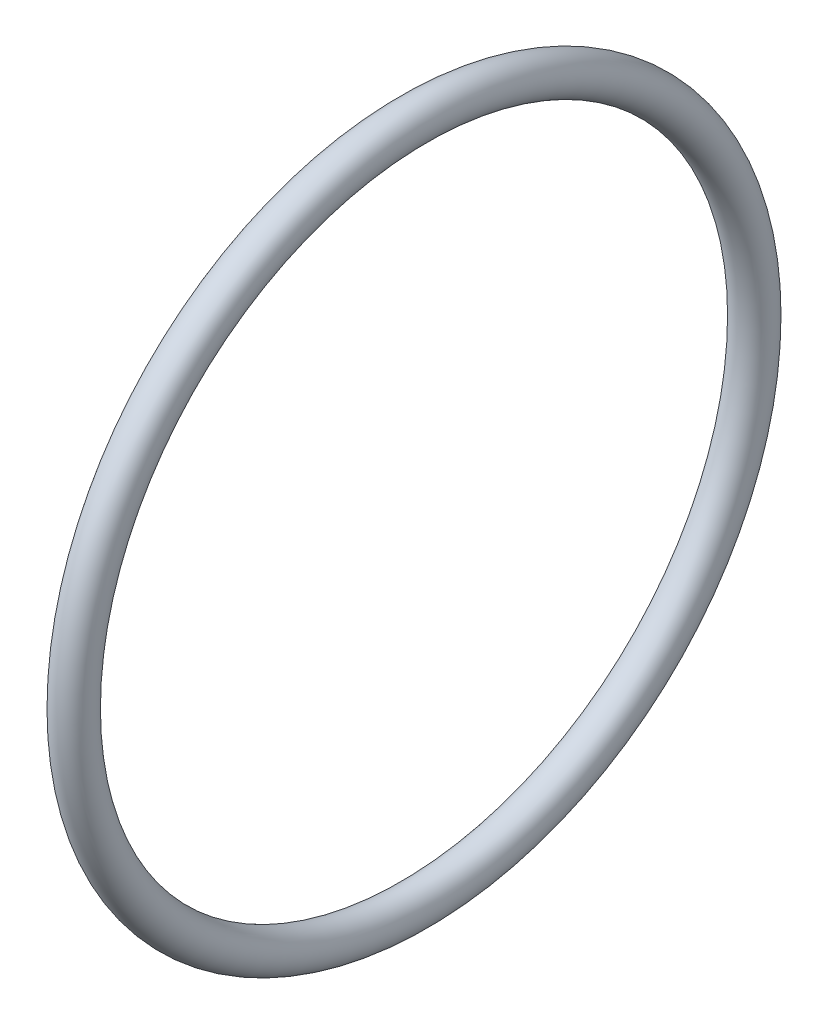
ISO-10303-21;
HEADER;
FILE_DESCRIPTION(('STEP AP214'),'2;1');
FILE_NAME('part.step','',(''),(''),'','','');
FILE_SCHEMA(('AUTOMOTIVE_DESIGN { 1 0 10303 214 1 1 1 1 }'));
ENDSEC;
DATA;
#1=APPLICATION_CONTEXT('core data for automotive mechanical design processes');
#2=APPLICATION_PROTOCOL_DEFINITION('international standard','automotive_design',2000,#1);
#3=PRODUCT_CONTEXT('',#1,'mechanical');
#4=PRODUCT('Part','Part','',(#3));
#5=PRODUCT_RELATED_PRODUCT_CATEGORY('part','',(#4));
#6=PRODUCT_DEFINITION_FORMATION('','',#4);
#7=PRODUCT_DEFINITION_CONTEXT('part definition',#1,'design');
#8=PRODUCT_DEFINITION('design','',#6,#7);
#9=PRODUCT_DEFINITION_SHAPE('','',#8);
#10=(LENGTH_UNIT() NAMED_UNIT(*) SI_UNIT(.MILLI.,.METRE.));
#11=(NAMED_UNIT(*) PLANE_ANGLE_UNIT() SI_UNIT($,.RADIAN.));
#12=(NAMED_UNIT(*) SI_UNIT($,.STERADIAN.) SOLID_ANGLE_UNIT());
#13=UNCERTAINTY_MEASURE_WITH_UNIT(LENGTH_MEASURE(1.E-05),#10,'distance_accuracy_value','');
#14=(GEOMETRIC_REPRESENTATION_CONTEXT(3) GLOBAL_UNCERTAINTY_ASSIGNED_CONTEXT((#13)) GLOBAL_UNIT_ASSIGNED_CONTEXT((#10,
#11,#12)) REPRESENTATION_CONTEXT('',''));
#15=CARTESIAN_POINT('',(0.,0.,0.));
#16=DIRECTION('',(0.,0.,1.));
#17=DIRECTION('',(1.,0.,0.));
#18=AXIS2_PLACEMENT_3D('',#15,#16,#17);
#19=CARTESIAN_POINT('',(-75.,0.,0.));
#20=DIRECTION('',(1.,0.,0.));
#21=DIRECTION('',(0.,0.,-1.));
#22=AXIS2_PLACEMENT_3D('',#19,#20,#21);
#23=TOROIDAL_SURFACE('',#22,72.,4.);
#24=CARTESIAN_POINT('',(-75.,62.3538290724795,-36.));
#25=DIRECTION('',(0.,-0.500000000000001,-0.866025403784438));
#26=DIRECTION('',(0.,0.866025403784438,-0.500000000000001));
#27=AXIS2_PLACEMENT_3D('',#24,#25,#26);
#28=CIRCLE('',#27,4.);
#29=CARTESIAN_POINT('',(-75.,65.8179306876173,-38.0000000000001));
#30=VERTEX_POINT('',#29);
#31=EDGE_CURVE('E10',#30,#30,#28,.T.);
#32=CARTESIAN_POINT('',(-75.,0.,0.));
#33=DIRECTION('',(1.,0.,0.));
#34=DIRECTION('',(0.,0.,-1.));
#35=AXIS2_PLACEMENT_3D('',#32,#33,#34);
#36=CIRCLE('',#35,76.);
#37=EDGE_CURVE('',#30,#30,#36,.T.);
#38=ORIENTED_EDGE('',*,*,#31,.F.);
#39=ORIENTED_EDGE('',*,*,#31,.T.);
#40=ORIENTED_EDGE('',*,*,#37,.T.);
#41=ORIENTED_EDGE('',*,*,#37,.F.);
#42=EDGE_LOOP('',(#38,#40,#39,#41));
#43=FACE_BOUND('',#42,.T.);
#44=ADVANCED_FACE('F39',(#43),#23,.T.);
#45=CLOSED_SHELL('',(#44));
#46=MANIFOLD_SOLID_BREP('B2',#45);
#47=ADVANCED_BREP_SHAPE_REPRESENTATION('',(#18,#46),#14);
#48=SHAPE_DEFINITION_REPRESENTATION(#9,#47);
ENDSEC;
END-ISO-10303-21;
